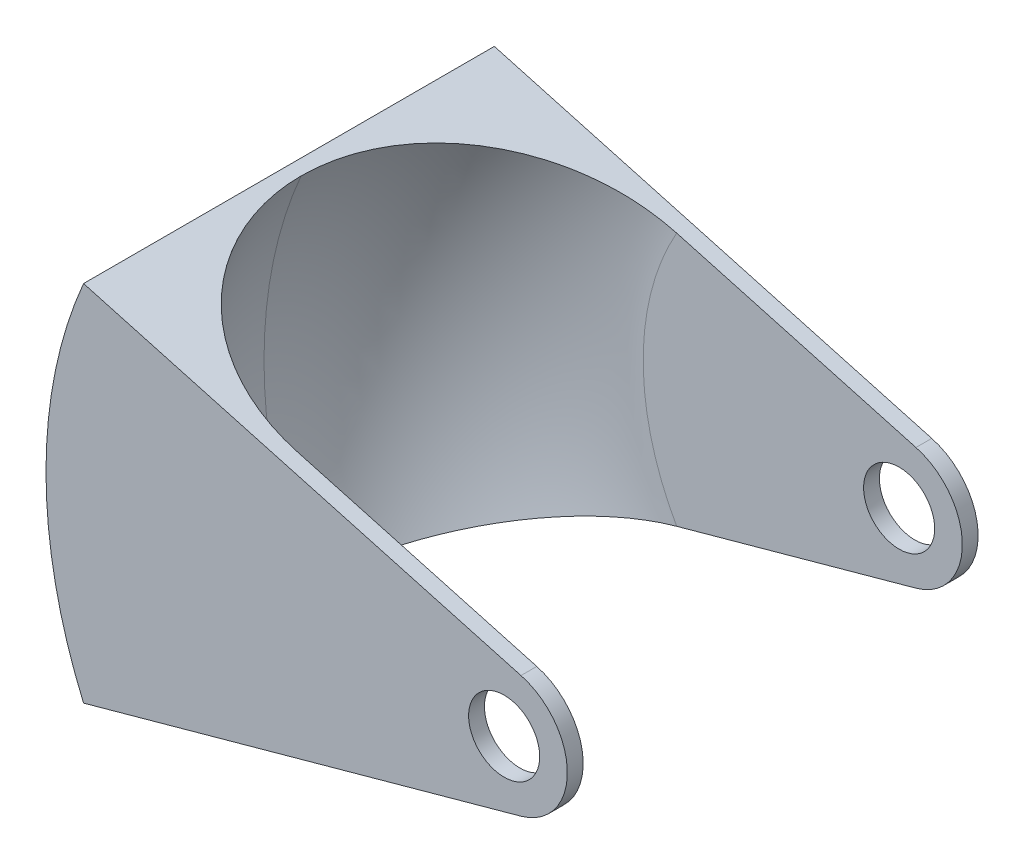
ISO-10303-21;
HEADER;
FILE_DESCRIPTION(('STEP AP214'),'2;1');
FILE_NAME('part.step','',(''),(''),'','','');
FILE_SCHEMA(('AUTOMOTIVE_DESIGN { 1 0 10303 214 1 1 1 1 }'));
ENDSEC;
DATA;
#1=APPLICATION_CONTEXT('core data for automotive mechanical design processes');
#2=APPLICATION_PROTOCOL_DEFINITION('international standard','automotive_design',2000,#1);
#3=PRODUCT_CONTEXT('',#1,'mechanical');
#4=PRODUCT('Part','Part','',(#3));
#5=PRODUCT_RELATED_PRODUCT_CATEGORY('part','',(#4));
#6=PRODUCT_DEFINITION_FORMATION('','',#4);
#7=PRODUCT_DEFINITION_CONTEXT('part definition',#1,'design');
#8=PRODUCT_DEFINITION('design','',#6,#7);
#9=PRODUCT_DEFINITION_SHAPE('','',#8);
#10=(LENGTH_UNIT() NAMED_UNIT(*) SI_UNIT(.MILLI.,.METRE.));
#11=(NAMED_UNIT(*) PLANE_ANGLE_UNIT() SI_UNIT($,.RADIAN.));
#12=(NAMED_UNIT(*) SI_UNIT($,.STERADIAN.) SOLID_ANGLE_UNIT());
#13=UNCERTAINTY_MEASURE_WITH_UNIT(LENGTH_MEASURE(1.E-05),#10,'distance_accuracy_value','');
#14=(GEOMETRIC_REPRESENTATION_CONTEXT(3) GLOBAL_UNCERTAINTY_ASSIGNED_CONTEXT((#13)) GLOBAL_UNIT_ASSIGNED_CONTEXT((#10,
#11,#12)) REPRESENTATION_CONTEXT('',''));
#15=CARTESIAN_POINT('',(0.,0.,0.));
#16=DIRECTION('',(0.,0.,1.));
#17=DIRECTION('',(1.,0.,0.));
#18=AXIS2_PLACEMENT_3D('',#15,#16,#17);
#19=CARTESIAN_POINT('',(-184.15,-73.025,-158.75));
#20=DIRECTION('',(0.,0.,-1.));
#21=DIRECTION('',(-1.,0.,0.));
#22=AXIS2_PLACEMENT_3D('',#19,#20,#21);
#23=PLANE('',#22);
#24=CARTESIAN_POINT('',(0.,0.,-158.75));
#25=DIRECTION('',(0.,0.,-1.));
#26=DIRECTION('',(-1.,0.,0.));
#27=AXIS2_PLACEMENT_3D('',#24,#25,#26);
#28=CIRCLE('',#27,14.2875);
#29=CARTESIAN_POINT('',(-14.2875,0.,-158.75));
#30=VERTEX_POINT('',#29);
#31=EDGE_CURVE('E159',#30,#30,#28,.F.);
#32=ORIENTED_EDGE('',*,*,#31,.F.);
#33=EDGE_LOOP('',(#32));
#34=FACE_BOUND('',#33,.T.);
#35=DIRECTION('',(-0.963934656431022,0.266139020309326,0.));
#36=VECTOR('',#35,1.);
#37=CARTESIAN_POINT('',(6.75993111585689,24.483940273348,-158.75));
#38=LINE('',#37,#36);
#39=CARTESIAN_POINT('',(6.75993111585689,24.483940273348,-158.75));
#40=VERTEX_POINT('',#39);
#41=CARTESIAN_POINT('',(-89.4077971932649,51.0355170081498,-158.75));
#42=VERTEX_POINT('',#41);
#43=EDGE_CURVE('E189',#40,#42,#38,.T.);
#44=ORIENTED_EDGE('',*,*,#43,.T.);
#45=CARTESIAN_POINT('',(0.599504236893755,0.,-158.75));
#46=DIRECTION('',(0.,0.,-1.));
#47=DIRECTION('',(-1.,0.,0.));
#48=AXIS2_PLACEMENT_3D('',#45,#46,#47);
#49=CIRCLE('',#48,103.469504236894);
#50=CARTESIAN_POINT('',(-89.4077971932647,-51.0355170081498,-158.75));
#51=VERTEX_POINT('',#50);
#52=EDGE_CURVE('E208',#42,#51,#49,.F.);
#53=ORIENTED_EDGE('',*,*,#52,.T.);
#54=DIRECTION('',(0.963934656431022,0.266139020309326,0.));
#55=VECTOR('',#54,1.);
#56=CARTESIAN_POINT('',(-169.051979802072,-73.025,-158.75));
#57=LINE('',#56,#55);
#58=CARTESIAN_POINT('',(6.7599311158569,-24.483940273348,-158.75));
#59=VERTEX_POINT('',#58);
#60=EDGE_CURVE('E190',#51,#59,#57,.T.);
#61=ORIENTED_EDGE('',*,*,#60,.T.);
#62=CARTESIAN_POINT('',(0.,0.,-158.75));
#63=DIRECTION('',(0.,0.,-1.));
#64=DIRECTION('',(-1.,0.,0.));
#65=AXIS2_PLACEMENT_3D('',#62,#63,#64);
#66=CIRCLE('',#65,25.4);
#67=EDGE_CURVE('E186',#59,#40,#66,.F.);
#68=ORIENTED_EDGE('',*,*,#67,.T.);
#69=EDGE_LOOP('',(#44,#53,#61,#68));
#70=FACE_BOUND('',#69,.T.);
#71=ADVANCED_FACE('F45',(#34,#70),#23,.F.);
#72=CARTESIAN_POINT('',(0.,0.,-165.1));
#73=DIRECTION('',(0.,0.,1.));
#74=DIRECTION('',(1.,0.,0.));
#75=AXIS2_PLACEMENT_3D('',#72,#73,#74);
#76=CYLINDRICAL_SURFACE('',#75,25.4);
#77=ORIENTED_EDGE('',*,*,#67,.F.);
#78=DIRECTION('',(0.,0.,1.));
#79=VECTOR('',#78,1.);
#80=CARTESIAN_POINT('',(6.75993111585689,-24.483940273348,-165.1));
#81=LINE('',#80,#79);
#82=CARTESIAN_POINT('',(6.75993111585689,-24.483940273348,-165.1));
#83=VERTEX_POINT('',#82);
#84=EDGE_CURVE('E169',#83,#59,#81,.T.);
#85=ORIENTED_EDGE('',*,*,#84,.F.);
#86=CARTESIAN_POINT('',(0.,0.,-165.1));
#87=DIRECTION('',(0.,0.,1.));
#88=DIRECTION('',(1.,0.,0.));
#89=AXIS2_PLACEMENT_3D('',#86,#87,#88);
#90=CIRCLE('',#89,25.4);
#91=CARTESIAN_POINT('',(6.75993111585689,24.483940273348,-165.1));
#92=VERTEX_POINT('',#91);
#93=EDGE_CURVE('E150',#83,#92,#90,.T.);
#94=ORIENTED_EDGE('',*,*,#93,.T.);
#95=DIRECTION('',(0.,0.,1.));
#96=VECTOR('',#95,1.);
#97=CARTESIAN_POINT('',(6.75993111585689,24.483940273348,-165.1));
#98=LINE('',#97,#96);
#99=EDGE_CURVE('E170',#92,#40,#98,.T.);
#100=ORIENTED_EDGE('',*,*,#99,.T.);
#101=EDGE_LOOP('',(#77,#85,#94,#100));
#102=FACE_BOUND('',#101,.T.);
#103=ADVANCED_FACE('F249',(#102),#76,.T.);
#104=CARTESIAN_POINT('',(-169.051979802072,-73.025,-165.1));
#105=DIRECTION('',(0.266139020309326,-0.963934656431022,0.));
#106=DIRECTION('',(0.963934656431022,0.266139020309326,0.));
#107=AXIS2_PLACEMENT_3D('',#104,#105,#106);
#108=PLANE('',#107);
#109=ORIENTED_EDGE('',*,*,#60,.F.);
#110=CARTESIAN_POINT('',(-89.4077971932648,-51.0355170081498,-158.75));
#111=CARTESIAN_POINT('',(-90.4655688461048,-51.3275640981882,-158.750016629747));
#112=CARTESIAN_POINT('',(-91.5233500341125,-51.6196138208533,-158.727706830901));
#113=CARTESIAN_POINT('',(-93.6371713132378,-52.2032325553621,-158.63829112092));
#114=CARTESIAN_POINT('',(-94.6932113693814,-52.4948015575495,-158.571184320682));
#115=CARTESIAN_POINT('',(-96.8018500538001,-53.0769893956083,-158.392022677165));
#116=CARTESIAN_POINT('',(-97.8544483393482,-53.367608136854,-158.279963487225));
#117=CARTESIAN_POINT('',(-99.9542854295265,-53.947365885225,-158.010874058202));
#118=CARTESIAN_POINT('',(-101.001524269907,-54.2365049022209,-157.853844119499));
#119=CARTESIAN_POINT('',(-103.08915190001,-54.8128916609494,-157.494821139265));
#120=CARTESIAN_POINT('',(-104.129538468974,-55.1001387895381,-157.292814194581));
#121=CARTESIAN_POINT('',(-106.201393764628,-55.6721708613484,-156.844005634722));
#122=CARTESIAN_POINT('',(-107.232861691721,-55.956955583804,-156.597200045885));
#123=CARTESIAN_POINT('',(-109.284817444043,-56.5234934606171,-156.059096000549));
#124=CARTESIAN_POINT('',(-110.305306675092,-56.8052470031168,-155.767803314986));
#125=CARTESIAN_POINT('',(-112.33370122637,-57.3652797139198,-155.141022732361));
#126=CARTESIAN_POINT('',(-113.341605347766,-57.6435585512294,-154.805530659586));
#127=CARTESIAN_POINT('',(-115.361664525464,-58.2012898942542,-154.08411660942));
#128=CARTESIAN_POINT('',(-116.373545188463,-58.4806666409286,-153.697367291957));
#129=CARTESIAN_POINT('',(-118.380425517133,-59.0347593493782,-152.879013669297));
#130=CARTESIAN_POINT('',(-119.375423519871,-59.3094748520233,-152.447404974972));
#131=CARTESIAN_POINT('',(-121.346482488791,-59.8536774071037,-151.540057956973));
#132=CARTESIAN_POINT('',(-122.322544480378,-60.1231647426497,-151.064322030948));
#133=CARTESIAN_POINT('',(-124.254000940688,-60.6564331822556,-150.069421356869));
#134=CARTESIAN_POINT('',(-125.209393395984,-60.9202137304151,-149.550252401749));
#135=CARTESIAN_POINT('',(-127.09695987615,-61.4413642985045,-148.469735493029));
#136=CARTESIAN_POINT('',(-128.029148346144,-61.6987383066832,-147.908414701177));
#137=CARTESIAN_POINT('',(-129.869212253612,-62.2067735789633,-146.744208689799));
#138=CARTESIAN_POINT('',(-130.777085257992,-62.457434171296,-146.141319332186));
#139=CARTESIAN_POINT('',(-132.566545720564,-62.9514980076918,-144.895142646856));
#140=CARTESIAN_POINT('',(-133.448136582393,-63.1949021914873,-144.251860583959));
#141=CARTESIAN_POINT('',(-135.183443246735,-63.6740143517389,-142.925970297819));
#142=CARTESIAN_POINT('',(-136.037156374538,-63.909721589717,-142.243358318362));
#143=CARTESIAN_POINT('',(-138.50855975899,-64.5920675051161,-140.176264484614));
#144=CARTESIAN_POINT('',(-140.085285119259,-65.0273959165175,-138.738476433746));
#145=CARTESIAN_POINT('',(-143.114683322661,-65.8638022689619,-135.72851605981));
#146=CARTESIAN_POINT('',(-144.567357375948,-66.2648805441242,-134.156345047984));
#147=CARTESIAN_POINT('',(-146.645029145685,-66.838518524285,-131.705917245745));
#148=CARTESIAN_POINT('',(-147.320855453424,-67.0251118273073,-130.873522727526));
#149=CARTESIAN_POINT('',(-148.637458542161,-67.3886213804028,-129.179465085388));
#150=CARTESIAN_POINT('',(-149.278238792717,-67.5655385884095,-128.317804872513));
#151=CARTESIAN_POINT('',(-150.523586137151,-67.9093746772783,-126.566687490214));
#152=CARTESIAN_POINT('',(-151.128150483768,-68.0762927996315,-125.677228219782));
#153=CARTESIAN_POINT('',(-152.299818183182,-68.3997861936804,-123.872260555779));
#154=CARTESIAN_POINT('',(-152.866925239209,-68.5563624878249,-122.956754750152));
#155=CARTESIAN_POINT('',(-153.954637580152,-68.8566760981571,-121.114859310508));
#156=CARTESIAN_POINT('',(-154.47580175669,-69.0005677223857,-120.188824799158));
#157=CARTESIAN_POINT('',(-155.479745649692,-69.2777531543508,-118.314743441774));
#158=CARTESIAN_POINT('',(-155.962529111946,-69.411047996287,-117.366698755535));
#159=CARTESIAN_POINT('',(-156.888939079825,-69.666826580044,-115.450054498626));
#160=CARTESIAN_POINT('',(-157.332559518801,-69.7893086468838,-114.481451772086));
#161=CARTESIAN_POINT('',(-158.179691792866,-70.0231989339358,-112.52565997174));
#162=CARTESIAN_POINT('',(-158.583207414851,-70.1346081996969,-111.538472663274));
#163=CARTESIAN_POINT('',(-159.349208750081,-70.346098515512,-109.547753402922));
#164=CARTESIAN_POINT('',(-159.711717340257,-70.4461858818077,-108.544230925113));
#165=CARTESIAN_POINT('',(-160.395255296282,-70.6349083442141,-106.522203420425));
#166=CARTESIAN_POINT('',(-160.716288578364,-70.7235445215837,-105.503699818244));
#167=CARTESIAN_POINT('',(-161.316260065834,-70.8891945714325,-103.453639131762));
#168=CARTESIAN_POINT('',(-161.595206165373,-70.9662106234594,-102.422084534832));
#169=CARTESIAN_POINT('',(-162.110531648899,-71.1084902047684,-100.347693290117));
#170=CARTESIAN_POINT('',(-162.346914144909,-71.1737545932688,-99.3048574730676));
#171=CARTESIAN_POINT('',(-162.826566437967,-71.306184930234,-96.9665643862472));
#172=CARTESIAN_POINT('',(-163.058708902292,-71.3702786606703,-95.6686333379788));
#173=CARTESIAN_POINT('',(-163.457061348196,-71.4802623913968,-93.0620647227455));
#174=CARTESIAN_POINT('',(-163.623276855148,-71.5261539172231,-91.7534280624099));
#175=CARTESIAN_POINT('',(-163.889121423905,-71.5995526819749,-89.1309417310484));
#176=CARTESIAN_POINT('',(-163.988853330833,-71.6270883160829,-87.817103289165));
#177=CARTESIAN_POINT('',(-164.121913297815,-71.6638257121488,-85.1855107122061));
#178=CARTESIAN_POINT('',(-164.155226116732,-71.6730232660816,-83.8677557478686));
#179=CARTESIAN_POINT('',(-164.155191747402,-71.6730137768286,-82.55));
#180=B_SPLINE_CURVE_WITH_KNOTS('',3,(#110,#111,#112,#113,#114,#115,#116,#117,#118,#119,#120,
#121,#122,#123,#124,#125,#126,#127,#128,#129,#130,#131,#132,#133,#134,#135,#136,#137,#138,#139,
#140,#141,#142,#143,#144,#145,#146,#147,#148,#149,#150,#151,#152,#153,#154,#155,#156,#157,#158,
#159,#160,#161,#162,#163,#164,#165,#166,#167,#168,#169,#170,#171,#172,#173,#174,#175,#176,#177,
#178,#179),.UNSPECIFIED.,.F.,.F.,(4,2,2,2,2,2,2,2,2,2,2,2,2,2,2,2,2,2,2,2,2,2,2,2,2,2,2,2,2,2,2,
2,2,2,4),(0.,3.29183134832938,6.58372803268538,9.87594310295202,13.1681361836255,
16.4613483532606,19.7548527753159,23.0479303212036,26.3413192022151,29.6964352664882,
33.051879911498,36.4071423455243,39.7627301585446,43.1161739562496,46.4699520674164,
49.8232939480533,53.1769566230482,59.7019455716888,66.2268708600167,69.4909937669997,
72.7547929386316,76.0188393822392,79.2825626400961,82.4985428049804,85.7142087179249,
88.9303718910444,92.1462310889784,95.3602872877417,98.5740397826414,101.787188733445,
105.0001026606,108.958479349889,112.916524215479,116.868431986894,120.821246495239),.UNSPECIFIED.);
#181=CARTESIAN_POINT('',(-164.155191747402,-71.6730137768286,-82.55));
#182=VERTEX_POINT('',#181);
#183=EDGE_CURVE('E11',#51,#182,#180,.T.);
#184=ORIENTED_EDGE('',*,*,#183,.T.);
#185=CARTESIAN_POINT('',(-164.155191747402,-71.6730137768286,-82.55));
#186=CARTESIAN_POINT('',(-164.15520609273,-71.6730177375241,-81.4871863440123));
#187=CARTESIAN_POINT('',(-164.133543852967,-71.6670368681469,-80.4243738699779));
#188=CARTESIAN_POINT('',(-164.046969342689,-71.643133945687,-78.3006498670434));
#189=CARTESIAN_POINT('',(-163.982057219621,-71.6252119333138,-77.239738331675));
#190=CARTESIAN_POINT('',(-163.809091089027,-71.577456583679,-75.1217688398414));
#191=CARTESIAN_POINT('',(-163.70103957996,-71.5476239362332,-74.0647106637824));
#192=CARTESIAN_POINT('',(-163.441998729391,-71.47610365451,-71.9562727887514));
#193=CARTESIAN_POINT('',(-163.291009425333,-71.4344160305709,-70.9048930848283));
#194=CARTESIAN_POINT('',(-162.946544481479,-71.3393104525357,-68.8107443833674));
#195=CARTESIAN_POINT('',(-162.753111911701,-71.2859043899222,-67.7679677608018));
#196=CARTESIAN_POINT('',(-162.324008748865,-71.1674304927479,-65.6917078276618));
#197=CARTESIAN_POINT('',(-162.088334204963,-71.1023615673726,-64.6582253958658));
#198=CARTESIAN_POINT('',(-161.575219518481,-70.9606923794712,-62.6025949565669));
#199=CARTESIAN_POINT('',(-161.297783724331,-70.8840933175315,-61.5804457808614));
#200=CARTESIAN_POINT('',(-160.701610604333,-70.719491983787,-59.5490891335786));
#201=CARTESIAN_POINT('',(-160.382869411902,-70.6314886444321,-58.5398828833157));
#202=CARTESIAN_POINT('',(-159.704581369724,-70.444215665057,-56.535971127331));
#203=CARTESIAN_POINT('',(-159.345021340767,-70.3449423863024,-55.5412704226716));
#204=CARTESIAN_POINT('',(-158.585803851875,-70.135325066967,-53.5683690474537));
#205=CARTESIAN_POINT('',(-158.186142642612,-70.02497999121,-52.590169929745));
#206=CARTESIAN_POINT('',(-157.347519505154,-69.793439047306,-50.6521735659549));
#207=CARTESIAN_POINT('',(-156.908560908634,-69.672244099023,-49.6923747682352));
#208=CARTESIAN_POINT('',(-155.992075805071,-69.4192057359317,-47.7926922425459));
#209=CARTESIAN_POINT('',(-155.514545700379,-69.2873613278247,-46.852810382618));
#210=CARTESIAN_POINT('',(-154.521930958667,-69.0133038352951,-44.9948965534347));
#211=CARTESIAN_POINT('',(-154.006854299788,-68.8710929536098,-44.0768599970179));
#212=CARTESIAN_POINT('',(-152.939952587185,-68.5765250856902,-42.2639528746993));
#213=CARTESIAN_POINT('',(-152.388124121719,-68.4241671574862,-41.3690844702801));
#214=CARTESIAN_POINT('',(-151.248806178812,-68.1096054191742,-39.6042250785748));
#215=CARTESIAN_POINT('',(-150.661320152312,-67.9474025618592,-38.7342316958325));
#216=CARTESIAN_POINT('',(-149.451713032923,-67.6134342253483,-37.0205221952245));
#217=CARTESIAN_POINT('',(-148.829588712029,-67.4416678549118,-36.1768085378763));
#218=CARTESIAN_POINT('',(-146.909209767367,-66.9114578790121,-33.6825045943551));
#219=CARTESIAN_POINT('',(-145.560058960411,-66.5389620136366,-32.0735677764436));
#220=CARTESIAN_POINT('',(-142.736867941031,-65.7594887505568,-28.9787093519041));
#221=CARTESIAN_POINT('',(-141.262827087565,-65.3525111758633,-27.4927883767741));
#222=CARTESIAN_POINT('',(-138.200152099956,-64.5069172185447,-24.6535396602136));
#223=CARTESIAN_POINT('',(-136.611505565877,-64.06829741234,-23.300226303936));
#224=CARTESIAN_POINT('',(-133.331252244519,-63.162630830598,-20.7354118386252));
#225=CARTESIAN_POINT('',(-131.639646126216,-62.6955842397625,-19.5239098083279));
#226=CARTESIAN_POINT('',(-128.149561382599,-61.7319839290299,-17.240038692237));
#227=CARTESIAN_POINT('',(-126.350244788385,-61.2351988488217,-16.1690477406709));
#228=CARTESIAN_POINT('',(-122.671848713064,-60.2196064315721,-14.1860961573351));
#229=CARTESIAN_POINT('',(-120.792764884614,-59.700797894244,-13.2741442071223));
#230=CARTESIAN_POINT('',(-116.968562444279,-58.6449488445755,-11.6148794966609));
#231=CARTESIAN_POINT('',(-115.023451810014,-58.1079105348283,-10.8675469275875));
#232=CARTESIAN_POINT('',(-111.08080977253,-57.0193607225708,-9.54155347463767));
#233=CARTESIAN_POINT('',(-109.083288279991,-56.4678519563651,-8.96286094862865));
#234=CARTESIAN_POINT('',(-105.620047713986,-55.5116632301036,-8.11615125218891));
#235=CARTESIAN_POINT('',(-104.163628740871,-55.1095509955464,-7.80655485854486));
#236=CARTESIAN_POINT('',(-101.236073499125,-54.3012631321092,-7.27596346605321));
#237=CARTESIAN_POINT('',(-99.7649397048523,-53.895088186391,-7.05495381940737));
#238=CARTESIAN_POINT('',(-96.8152542087748,-53.0806902363751,-6.70197649540314));
#239=CARTESIAN_POINT('',(-95.3367193345219,-52.6724718781061,-6.56985833052524));
#240=CARTESIAN_POINT('',(-93.1153444292531,-52.0591579599025,-6.4378641261461));
#241=CARTESIAN_POINT('',(-92.3742045680975,-51.8545318109782,-6.40489658132852));
#242=CARTESIAN_POINT('',(-90.8913218729215,-51.4451130344099,-6.36096431503527));
#243=CARTESIAN_POINT('',(-90.1495790414491,-51.2403204074694,-6.34999950106202));
#244=CARTESIAN_POINT('',(-89.4077971932647,-51.0355170081498,-6.34999999999999));
#245=B_SPLINE_CURVE_WITH_KNOTS('',3,(#185,#186,#187,#188,#189,#190,#191,#192,#193,#194,#195,
#196,#197,#198,#199,#200,#201,#202,#203,#204,#205,#206,#207,#208,#209,#210,#211,#212,#213,#214,
#215,#216,#217,#218,#219,#220,#221,#222,#223,#224,#225,#226,#227,#228,#229,#230,#231,#232,#233,
#234,#235,#236,#237,#238,#239,#240,#241,#242,#243,#244),.UNSPECIFIED.,.F.,.F.,(4,2,2,2,2,2,2,2,
2,2,2,2,2,2,2,2,2,2,2,2,2,2,2,2,2,2,2,2,2,4),(0.,3.18820170907249,6.37639254903345,
9.56439876863611,12.7524022081165,15.9371854069399,19.122266630546,22.3070164336525,
25.4920645756616,28.6781440172765,31.8645216247958,35.0506293431039,38.2370345806729,
41.4227647122716,44.6087909946407,47.7945094232769,50.980525233128,57.3698933461778,
63.7592942568188,70.1493875182574,76.5394392647429,82.9881040723787,89.4371207870172,
95.885361060198,102.332390662208,106.956843433806,111.580531237454,116.196371607935,
118.504827091008,120.813272869513),.UNSPECIFIED.);
#246=CARTESIAN_POINT('',(-89.4077971932647,-51.0355170081498,-6.35));
#247=VERTEX_POINT('',#246);
#248=EDGE_CURVE('E218',#182,#247,#245,.T.);
#249=ORIENTED_EDGE('',*,*,#248,.T.);
#250=DIRECTION('',(-0.963934656431022,-0.266139020309326,0.));
#251=VECTOR('',#250,1.);
#252=CARTESIAN_POINT('',(-169.051979802072,-73.025,-6.34999999999999));
#253=LINE('',#252,#251);
#254=CARTESIAN_POINT('',(6.7599311158569,-24.483940273348,-6.35));
#255=VERTEX_POINT('',#254);
#256=EDGE_CURVE('E127',#255,#247,#253,.T.);
#257=ORIENTED_EDGE('',*,*,#256,.F.);
#258=DIRECTION('',(0.,0.,1.));
#259=VECTOR('',#258,1.);
#260=CARTESIAN_POINT('',(6.75993111585689,-24.483940273348,-165.1));
#261=LINE('',#260,#259);
#262=CARTESIAN_POINT('',(6.75993111585689,-24.483940273348,0.));
#263=VERTEX_POINT('',#262);
#264=EDGE_CURVE('E136',#255,#263,#261,.T.);
#265=ORIENTED_EDGE('',*,*,#264,.T.);
#266=DIRECTION('',(0.963934656431022,0.266139020309326,0.));
#267=VECTOR('',#266,1.);
#268=CARTESIAN_POINT('',(-169.051979802072,-73.025,0.));
#269=LINE('',#268,#267);
#270=CARTESIAN_POINT('',(-169.051979802072,-73.025,0.));
#271=VERTEX_POINT('',#270);
#272=EDGE_CURVE('E146',#271,#263,#269,.T.);
#273=ORIENTED_EDGE('',*,*,#272,.F.);
#274=DIRECTION('',(0.,0.,1.));
#275=VECTOR('',#274,1.);
#276=CARTESIAN_POINT('',(-169.051979802072,-73.025,-165.1));
#277=LINE('',#276,#275);
#278=CARTESIAN_POINT('',(-169.051979802072,-73.025,-165.1));
#279=VERTEX_POINT('',#278);
#280=EDGE_CURVE('E175',#279,#271,#277,.T.);
#281=ORIENTED_EDGE('',*,*,#280,.F.);
#282=DIRECTION('',(0.963934656431022,0.266139020309326,0.));
#283=VECTOR('',#282,1.);
#284=CARTESIAN_POINT('',(-169.051979802072,-73.025,-165.1));
#285=LINE('',#284,#283);
#286=EDGE_CURVE('E165',#279,#83,#285,.T.);
#287=ORIENTED_EDGE('',*,*,#286,.T.);
#288=ORIENTED_EDGE('',*,*,#84,.T.);
#289=EDGE_LOOP('',(#109,#184,#249,#257,#265,#273,#281,#287,#288));
#290=FACE_BOUND('',#289,.T.);
#291=ADVANCED_FACE('F245',(#290),#108,.T.);
#292=CARTESIAN_POINT('',(0.,0.,-165.1));
#293=DIRECTION('',(0.,0.,1.));
#294=DIRECTION('',(1.,0.,0.));
#295=AXIS2_PLACEMENT_3D('',#292,#293,#294);
#296=CYLINDRICAL_SURFACE('',#295,184.15);
#297=ORIENTED_EDGE('',*,*,#280,.T.);
#298=CARTESIAN_POINT('',(0.,0.,0.));
#299=DIRECTION('',(0.,0.,1.));
#300=DIRECTION('',(1.,0.,0.));
#301=AXIS2_PLACEMENT_3D('',#298,#299,#300);
#302=CIRCLE('',#301,184.15);
#303=CARTESIAN_POINT('',(-169.051979802072,73.025,0.));
#304=VERTEX_POINT('',#303);
#305=EDGE_CURVE('E153',#304,#271,#302,.T.);
#306=ORIENTED_EDGE('',*,*,#305,.F.);
#307=DIRECTION('',(0.,0.,1.));
#308=VECTOR('',#307,1.);
#309=CARTESIAN_POINT('',(-169.051979802072,73.025,-165.1));
#310=LINE('',#309,#308);
#311=CARTESIAN_POINT('',(-169.051979802072,73.025,-165.1));
#312=VERTEX_POINT('',#311);
#313=EDGE_CURVE('E164',#312,#304,#310,.T.);
#314=ORIENTED_EDGE('',*,*,#313,.F.);
#315=CARTESIAN_POINT('',(0.,0.,-165.1));
#316=DIRECTION('',(0.,0.,1.));
#317=DIRECTION('',(1.,0.,0.));
#318=AXIS2_PLACEMENT_3D('',#315,#316,#317);
#319=CIRCLE('',#318,184.15);
#320=EDGE_CURVE('E171',#312,#279,#319,.T.);
#321=ORIENTED_EDGE('',*,*,#320,.T.);
#322=EDGE_LOOP('',(#297,#306,#314,#321));
#323=FACE_BOUND('',#322,.T.);
#324=ADVANCED_FACE('F233',(#323),#296,.T.);
#325=CARTESIAN_POINT('',(6.75993111585689,24.483940273348,-165.1));
#326=DIRECTION('',(0.266139020309326,0.963934656431022,0.));
#327=DIRECTION('',(-0.963934656431022,0.266139020309326,0.));
#328=AXIS2_PLACEMENT_3D('',#325,#326,#327);
#329=PLANE('',#328);
#330=ORIENTED_EDGE('',*,*,#43,.F.);
#331=ORIENTED_EDGE('',*,*,#99,.F.);
#332=DIRECTION('',(-0.963934656431022,0.266139020309326,0.));
#333=VECTOR('',#332,1.);
#334=CARTESIAN_POINT('',(6.75993111585689,24.483940273348,-165.1));
#335=LINE('',#334,#333);
#336=EDGE_CURVE('E176',#92,#312,#335,.T.);
#337=ORIENTED_EDGE('',*,*,#336,.T.);
#338=ORIENTED_EDGE('',*,*,#313,.T.);
#339=DIRECTION('',(-0.963934656431022,0.266139020309326,0.));
#340=VECTOR('',#339,1.);
#341=CARTESIAN_POINT('',(6.75993111585689,24.483940273348,0.));
#342=LINE('',#341,#340);
#343=CARTESIAN_POINT('',(6.75993111585689,24.483940273348,0.));
#344=VERTEX_POINT('',#343);
#345=EDGE_CURVE('E143',#344,#304,#342,.T.);
#346=ORIENTED_EDGE('',*,*,#345,.F.);
#347=DIRECTION('',(0.,0.,1.));
#348=VECTOR('',#347,1.);
#349=CARTESIAN_POINT('',(6.75993111585689,24.483940273348,-165.1));
#350=LINE('',#349,#348);
#351=CARTESIAN_POINT('',(6.75993111585689,24.483940273348,-6.34999999999999));
#352=VERTEX_POINT('',#351);
#353=EDGE_CURVE('E134',#352,#344,#350,.T.);
#354=ORIENTED_EDGE('',*,*,#353,.F.);
#355=DIRECTION('',(0.963934656431022,-0.266139020309326,0.));
#356=VECTOR('',#355,1.);
#357=CARTESIAN_POINT('',(6.7599311158569,24.483940273348,-6.34999999999999));
#358=LINE('',#357,#356);
#359=CARTESIAN_POINT('',(-89.4077971932649,51.0355170081498,-6.34999999999999));
#360=VERTEX_POINT('',#359);
#361=EDGE_CURVE('E117',#360,#352,#358,.T.);
#362=ORIENTED_EDGE('',*,*,#361,.F.);
#363=CARTESIAN_POINT('',(-89.4077971932648,51.0355170081498,-6.35));
#364=CARTESIAN_POINT('',(-90.4655688461048,51.3275640981882,-6.34998337025323));
#365=CARTESIAN_POINT('',(-91.5233500341126,51.6196138208533,-6.37229316909881));
#366=CARTESIAN_POINT('',(-93.6371713132378,52.2032325553621,-6.4617088790804));
#367=CARTESIAN_POINT('',(-94.6932113693815,52.4948015575495,-6.52881567931757));
#368=CARTESIAN_POINT('',(-96.8018500538001,53.0769893956083,-6.70797732283453));
#369=CARTESIAN_POINT('',(-97.8544483393482,53.367608136854,-6.82003651277478));
#370=CARTESIAN_POINT('',(-99.9542854295265,53.947365885225,-7.08912594179762));
#371=CARTESIAN_POINT('',(-101.001524269907,54.2365049022209,-7.24615588050143));
#372=CARTESIAN_POINT('',(-103.089151900011,54.8128916609495,-7.60517886073545));
#373=CARTESIAN_POINT('',(-104.129538468974,55.1001387895381,-7.80718580541916));
#374=CARTESIAN_POINT('',(-106.201393764628,55.6721708613484,-8.25599436527813));
#375=CARTESIAN_POINT('',(-107.232861691721,55.956955583804,-8.50279995411527));
#376=CARTESIAN_POINT('',(-109.284817444043,56.5234934606172,-9.04090399945071));
#377=CARTESIAN_POINT('',(-110.305306675092,56.8052470031168,-9.33219668501395));
#378=CARTESIAN_POINT('',(-112.33370122637,57.3652797139198,-9.95897726763909));
#379=CARTESIAN_POINT('',(-113.341605347766,57.6435585512294,-10.2944693404143));
#380=CARTESIAN_POINT('',(-115.361664525464,58.2012898942542,-11.0158833905797));
#381=CARTESIAN_POINT('',(-116.373545188463,58.4806666409286,-11.4026327080434));
#382=CARTESIAN_POINT('',(-118.380425517133,59.0347593493782,-12.2209863307029));
#383=CARTESIAN_POINT('',(-119.375423519871,59.3094748520233,-12.6525950250284));
#384=CARTESIAN_POINT('',(-121.346482488791,59.8536774071037,-13.5599420430268));
#385=CARTESIAN_POINT('',(-122.322544480378,60.1231647426498,-14.0356779690521));
#386=CARTESIAN_POINT('',(-124.254000940688,60.6564331822556,-15.0305786431307));
#387=CARTESIAN_POINT('',(-125.209393395984,60.9202137304151,-15.5497475982513));
#388=CARTESIAN_POINT('',(-127.09695987615,61.4413642985046,-16.6302645069706));
#389=CARTESIAN_POINT('',(-128.029148346144,61.6987383066833,-17.1915852988227));
#390=CARTESIAN_POINT('',(-129.869212253612,62.2067735789633,-18.3557913102014));
#391=CARTESIAN_POINT('',(-130.777085257993,62.457434171296,-18.9586806678141));
#392=CARTESIAN_POINT('',(-132.566545720564,62.9514980076918,-20.2048573531436));
#393=CARTESIAN_POINT('',(-133.448136582393,63.1949021914873,-20.8481394160409));
#394=CARTESIAN_POINT('',(-135.183443246735,63.674014351739,-22.1740297021813));
#395=CARTESIAN_POINT('',(-136.037156374538,63.909721589717,-22.8566416816383));
#396=CARTESIAN_POINT('',(-138.50855975899,64.5920675051161,-24.9237355153856));
#397=CARTESIAN_POINT('',(-140.085285119259,65.0273959165175,-26.3615235662539));
#398=CARTESIAN_POINT('',(-143.114683322661,65.8638022689619,-29.3714839401898));
#399=CARTESIAN_POINT('',(-144.567357375948,66.2648805441242,-30.9436549520156));
#400=CARTESIAN_POINT('',(-146.645029145685,66.838518524285,-33.3940827542546));
#401=CARTESIAN_POINT('',(-147.320855453424,67.0251118273073,-34.2264772724735));
#402=CARTESIAN_POINT('',(-148.637458542161,67.3886213804028,-35.9205349146123));
#403=CARTESIAN_POINT('',(-149.278238792717,67.5655385884096,-36.7821951274869));
#404=CARTESIAN_POINT('',(-150.523586137151,67.9093746772784,-38.533312509786));
#405=CARTESIAN_POINT('',(-151.128150483768,68.0762927996315,-39.4227717802178));
#406=CARTESIAN_POINT('',(-152.299818183182,68.3997861936804,-41.2277394442208));
#407=CARTESIAN_POINT('',(-152.866925239209,68.5563624878249,-42.1432452498484));
#408=CARTESIAN_POINT('',(-153.954637580153,68.8566760981571,-43.9851406894921));
#409=CARTESIAN_POINT('',(-154.47580175669,69.0005677223857,-44.9111752008424));
#410=CARTESIAN_POINT('',(-155.479745649692,69.2777531543508,-46.7852565582258));
#411=CARTESIAN_POINT('',(-155.962529111946,69.411047996287,-47.7333012444648));
#412=CARTESIAN_POINT('',(-156.888939079825,69.666826580044,-49.6499455013738));
#413=CARTESIAN_POINT('',(-157.332559518801,69.7893086468838,-50.6185482279144));
#414=CARTESIAN_POINT('',(-158.179691792866,70.0231989339359,-52.5743400282599));
#415=CARTESIAN_POINT('',(-158.583207414851,70.1346081996969,-53.5615273367262));
#416=CARTESIAN_POINT('',(-159.349208750081,70.346098515512,-55.5522465970776));
#417=CARTESIAN_POINT('',(-159.711717340257,70.4461858818077,-56.555769074887));
#418=CARTESIAN_POINT('',(-160.395255296282,70.6349083442142,-58.5777965795748));
#419=CARTESIAN_POINT('',(-160.716288578364,70.7235445215837,-59.596300181756));
#420=CARTESIAN_POINT('',(-161.316260065834,70.8891945714325,-61.646360868238));
#421=CARTESIAN_POINT('',(-161.595206165373,70.9662106234594,-62.6779154651675));
#422=CARTESIAN_POINT('',(-162.110531648899,71.1084902047684,-64.7523067098832));
#423=CARTESIAN_POINT('',(-162.346914144909,71.1737545932688,-65.7951425269324));
#424=CARTESIAN_POINT('',(-162.826566437967,71.306184930234,-68.1334356137528));
#425=CARTESIAN_POINT('',(-163.058708902292,71.3702786606703,-69.4313666620212));
#426=CARTESIAN_POINT('',(-163.457061348196,71.4802623913969,-72.0379352772545));
#427=CARTESIAN_POINT('',(-163.623276855148,71.5261539172231,-73.3465719375901));
#428=CARTESIAN_POINT('',(-163.889121423905,71.5995526819749,-75.9690582689516));
#429=CARTESIAN_POINT('',(-163.988853330834,71.6270883160829,-77.282896710835));
#430=CARTESIAN_POINT('',(-164.121913297816,71.6638257121488,-79.9144892877939));
#431=CARTESIAN_POINT('',(-164.155226116732,71.6730232660816,-81.2322442521314));
#432=CARTESIAN_POINT('',(-164.155191747402,71.6730137768286,-82.55));
#433=B_SPLINE_CURVE_WITH_KNOTS('',3,(#363,#364,#365,#366,#367,#368,#369,#370,#371,#372,#373,
#374,#375,#376,#377,#378,#379,#380,#381,#382,#383,#384,#385,#386,#387,#388,#389,#390,#391,#392,
#393,#394,#395,#396,#397,#398,#399,#400,#401,#402,#403,#404,#405,#406,#407,#408,#409,#410,#411,
#412,#413,#414,#415,#416,#417,#418,#419,#420,#421,#422,#423,#424,#425,#426,#427,#428,#429,#430,
#431,#432),.UNSPECIFIED.,.F.,.F.,(4,2,2,2,2,2,2,2,2,2,2,2,2,2,2,2,2,2,2,2,2,2,2,2,2,2,2,2,2,2,2,
2,2,2,4),(0.,3.29183134832936,6.58372803268535,9.875943102952,13.1681361836255,16.4613483532606,
19.7548527753159,23.0479303212036,26.3413192022151,29.6964352664881,33.051879911498,
36.4071423455243,39.7627301585445,43.1161739562495,46.4699520674164,49.8232939480533,
53.1769566230482,59.7019455716888,66.2268708600167,69.4909937669997,72.7547929386316,
76.0188393822391,79.2825626400961,82.4985428049804,85.7142087179249,88.9303718910444,
92.1462310889784,95.3602872877417,98.5740397826414,101.787188733445,105.0001026606,
108.958479349889,112.916524215479,116.868431986894,120.821246495239),.UNSPECIFIED.);
#434=CARTESIAN_POINT('',(-164.155191747402,71.6730137768286,-82.55));
#435=VERTEX_POINT('',#434);
#436=EDGE_CURVE('E69',#360,#435,#433,.T.);
#437=ORIENTED_EDGE('',*,*,#436,.T.);
#438=CARTESIAN_POINT('',(-164.155191747402,71.6730137768286,-82.55));
#439=CARTESIAN_POINT('',(-164.155206092731,71.6730177375242,-83.6128136559878));
#440=CARTESIAN_POINT('',(-164.133543852967,71.667036868147,-84.6756261300221));
#441=CARTESIAN_POINT('',(-164.046969342689,71.643133945687,-86.7993501329566));
#442=CARTESIAN_POINT('',(-163.982057219622,71.6252119333138,-87.860261668325));
#443=CARTESIAN_POINT('',(-163.809091089027,71.577456583679,-89.9782311601586));
#444=CARTESIAN_POINT('',(-163.70103957996,71.5476239362332,-91.0352893362177));
#445=CARTESIAN_POINT('',(-163.441998729391,71.47610365451,-93.1437272112486));
#446=CARTESIAN_POINT('',(-163.291009425333,71.434416030571,-94.1951069151717));
#447=CARTESIAN_POINT('',(-162.946544481479,71.3393104525357,-96.2892556166326));
#448=CARTESIAN_POINT('',(-162.753111911701,71.2859043899222,-97.3320322391982));
#449=CARTESIAN_POINT('',(-162.324008748865,71.1674304927479,-99.4082921723382));
#450=CARTESIAN_POINT('',(-162.088334204963,71.1023615673726,-100.441774604134));
#451=CARTESIAN_POINT('',(-161.575219518481,70.9606923794712,-102.497405043433));
#452=CARTESIAN_POINT('',(-161.297783724331,70.8840933175315,-103.519554219139));
#453=CARTESIAN_POINT('',(-160.701610604333,70.7194919837871,-105.550910866421));
#454=CARTESIAN_POINT('',(-160.382869411902,70.6314886444321,-106.560117116684));
#455=CARTESIAN_POINT('',(-159.704581369724,70.444215665057,-108.564028872669));
#456=CARTESIAN_POINT('',(-159.345021340767,70.3449423863024,-109.558729577328));
#457=CARTESIAN_POINT('',(-158.585803851875,70.1353250669671,-111.531630952546));
#458=CARTESIAN_POINT('',(-158.186142642612,70.0249799912101,-112.509830070255));
#459=CARTESIAN_POINT('',(-157.347519505154,69.793439047306,-114.447826434045));
#460=CARTESIAN_POINT('',(-156.908560908634,69.672244099023,-115.407625231765));
#461=CARTESIAN_POINT('',(-155.992075805071,69.4192057359317,-117.307307757454));
#462=CARTESIAN_POINT('',(-155.514545700379,69.2873613278247,-118.247189617382));
#463=CARTESIAN_POINT('',(-154.521930958667,69.0133038352951,-120.105103446565));
#464=CARTESIAN_POINT('',(-154.006854299788,68.8710929536098,-121.023140002982));
#465=CARTESIAN_POINT('',(-152.939952587185,68.5765250856903,-122.836047125301));
#466=CARTESIAN_POINT('',(-152.388124121719,68.4241671574862,-123.73091552972));
#467=CARTESIAN_POINT('',(-151.248806178812,68.1096054191742,-125.495774921425));
#468=CARTESIAN_POINT('',(-150.661320152312,67.9474025618592,-126.365768304168));
#469=CARTESIAN_POINT('',(-149.451713032923,67.6134342253483,-128.079477804776));
#470=CARTESIAN_POINT('',(-148.82958871203,67.4416678549118,-128.923191462124));
#471=CARTESIAN_POINT('',(-146.909209767367,66.9114578790121,-131.417495405645));
#472=CARTESIAN_POINT('',(-145.560058960411,66.5389620136366,-133.026432223556));
#473=CARTESIAN_POINT('',(-142.736867941031,65.7594887505568,-136.121290648096));
#474=CARTESIAN_POINT('',(-141.262827087565,65.3525111758634,-137.607211623226));
#475=CARTESIAN_POINT('',(-138.200152099956,64.5069172185447,-140.446460339786));
#476=CARTESIAN_POINT('',(-136.611505565877,64.0682974123401,-141.799773696064));
#477=CARTESIAN_POINT('',(-133.331252244519,63.162630830598,-144.364588161375));
#478=CARTESIAN_POINT('',(-131.639646126217,62.6955842397625,-145.576090191672));
#479=CARTESIAN_POINT('',(-128.149561382599,61.7319839290299,-147.859961307763));
#480=CARTESIAN_POINT('',(-126.350244788385,61.2351988488217,-148.930952259329));
#481=CARTESIAN_POINT('',(-122.671848713064,60.2196064315721,-150.913903842665));
#482=CARTESIAN_POINT('',(-120.792764884614,59.700797894244,-151.825855792878));
#483=CARTESIAN_POINT('',(-116.968562444279,58.6449488445756,-153.485120503339));
#484=CARTESIAN_POINT('',(-115.023451810015,58.1079105348283,-154.232453072413));
#485=CARTESIAN_POINT('',(-111.08080977253,57.0193607225708,-155.558446525362));
#486=CARTESIAN_POINT('',(-109.083288279991,56.4678519563651,-156.137139051371));
#487=CARTESIAN_POINT('',(-105.620047713986,55.5116632301036,-156.983848747811));
#488=CARTESIAN_POINT('',(-104.163628740871,55.1095509955464,-157.293445141455));
#489=CARTESIAN_POINT('',(-101.236073499125,54.3012631321092,-157.824036533947));
#490=CARTESIAN_POINT('',(-99.7649397048524,53.895088186391,-158.045046180593));
#491=CARTESIAN_POINT('',(-96.8152542087749,53.0806902363751,-158.398023504597));
#492=CARTESIAN_POINT('',(-95.336719334522,52.6724718781062,-158.530141669475));
#493=CARTESIAN_POINT('',(-93.1153444292532,52.0591579599025,-158.662135873854));
#494=CARTESIAN_POINT('',(-92.3742045680976,51.8545318109783,-158.695103418671));
#495=CARTESIAN_POINT('',(-90.8913218729216,51.4451130344099,-158.739035684965));
#496=CARTESIAN_POINT('',(-90.1495790414492,51.2403204074694,-158.750000498938));
#497=CARTESIAN_POINT('',(-89.4077971932648,51.0355170081498,-158.75));
#498=B_SPLINE_CURVE_WITH_KNOTS('',3,(#438,#439,#440,#441,#442,#443,#444,#445,#446,#447,#448,
#449,#450,#451,#452,#453,#454,#455,#456,#457,#458,#459,#460,#461,#462,#463,#464,#465,#466,#467,
#468,#469,#470,#471,#472,#473,#474,#475,#476,#477,#478,#479,#480,#481,#482,#483,#484,#485,#486,
#487,#488,#489,#490,#491,#492,#493,#494,#495,#496,#497),.UNSPECIFIED.,.F.,.F.,(4,2,2,2,2,2,2,2,
2,2,2,2,2,2,2,2,2,2,2,2,2,2,2,2,2,2,2,2,2,4),(0.,3.18820170907249,6.37639254903346,
9.56439876863611,12.7524022081165,15.9371854069399,19.122266630546,22.3070164336524,
25.4920645756616,28.6781440172765,31.8645216247958,35.0506293431039,38.2370345806729,
41.4227647122716,44.6087909946407,47.7945094232769,50.980525233128,57.3698933461778,
63.7592942568187,70.1493875182573,76.5394392647428,82.9881040723787,89.4371207870172,
95.885361060198,102.332390662208,106.956843433806,111.580531237454,116.196371607935,
118.504827091008,120.813272869513),.UNSPECIFIED.);
#499=EDGE_CURVE('E56',#435,#42,#498,.T.);
#500=ORIENTED_EDGE('',*,*,#499,.T.);
#501=EDGE_LOOP('',(#330,#331,#337,#338,#346,#354,#362,#437,#500));
#502=FACE_BOUND('',#501,.T.);
#503=ADVANCED_FACE('F141',(#502),#329,.T.);
#504=CARTESIAN_POINT('',(0.,0.,-165.1));
#505=DIRECTION('',(0.,0.,1.));
#506=DIRECTION('',(1.,0.,0.));
#507=AXIS2_PLACEMENT_3D('',#504,#505,#506);
#508=CYLINDRICAL_SURFACE('',#507,14.2875);
#509=ORIENTED_EDGE('',*,*,#31,.T.);
#510=EDGE_LOOP('',(#509));
#511=FACE_BOUND('',#510,.T.);
#512=CARTESIAN_POINT('',(0.,0.,-165.1));
#513=DIRECTION('',(0.,0.,1.));
#514=DIRECTION('',(1.,0.,0.));
#515=AXIS2_PLACEMENT_3D('',#512,#513,#514);
#516=CIRCLE('',#515,14.2875);
#517=CARTESIAN_POINT('',(14.2875,0.,-165.1));
#518=VERTEX_POINT('',#517);
#519=EDGE_CURVE('E163',#518,#518,#516,.T.);
#520=ORIENTED_EDGE('',*,*,#519,.F.);
#521=EDGE_LOOP('',(#520));
#522=FACE_BOUND('',#521,.T.);
#523=ADVANCED_FACE('F232',(#511,#522),#508,.F.);
#524=CARTESIAN_POINT('',(0.,0.,-165.1));
#525=DIRECTION('',(0.,0.,1.));
#526=DIRECTION('',(1.,0.,0.));
#527=AXIS2_PLACEMENT_3D('',#524,#525,#526);
#528=PLANE('',#527);
#529=ORIENTED_EDGE('',*,*,#519,.T.);
#530=EDGE_LOOP('',(#529));
#531=FACE_BOUND('',#530,.T.);
#532=ORIENTED_EDGE('',*,*,#93,.F.);
#533=ORIENTED_EDGE('',*,*,#286,.F.);
#534=ORIENTED_EDGE('',*,*,#320,.F.);
#535=ORIENTED_EDGE('',*,*,#336,.F.);
#536=EDGE_LOOP('',(#532,#533,#534,#535));
#537=FACE_BOUND('',#536,.T.);
#538=ADVANCED_FACE('F254',(#531,#537),#528,.F.);
#539=CARTESIAN_POINT('',(-184.15,-73.025,-6.34999999999999));
#540=DIRECTION('',(0.,0.,1.));
#541=DIRECTION('',(1.,0.,0.));
#542=AXIS2_PLACEMENT_3D('',#539,#540,#541);
#543=PLANE('',#542);
#544=CARTESIAN_POINT('',(0.,0.,-6.34999999999999));
#545=DIRECTION('',(0.,0.,1.));
#546=DIRECTION('',(1.,0.,0.));
#547=AXIS2_PLACEMENT_3D('',#544,#545,#546);
#548=CIRCLE('',#547,14.2875);
#549=CARTESIAN_POINT('',(14.2875,0.,-6.34999999999999));
#550=VERTEX_POINT('',#549);
#551=EDGE_CURVE('E128',#550,#550,#548,.F.);
#552=ORIENTED_EDGE('',*,*,#551,.F.);
#553=EDGE_LOOP('',(#552));
#554=FACE_BOUND('',#553,.T.);
#555=ORIENTED_EDGE('',*,*,#256,.T.);
#556=CARTESIAN_POINT('',(0.599504236893757,0.,-6.34999999999999));
#557=DIRECTION('',(0.,0.,1.));
#558=DIRECTION('',(1.,0.,0.));
#559=AXIS2_PLACEMENT_3D('',#556,#557,#558);
#560=CIRCLE('',#559,103.469504236894);
#561=EDGE_CURVE('E124',#247,#360,#560,.F.);
#562=ORIENTED_EDGE('',*,*,#561,.T.);
#563=ORIENTED_EDGE('',*,*,#361,.T.);
#564=CARTESIAN_POINT('',(0.,0.,-6.34999999999999));
#565=DIRECTION('',(0.,0.,1.));
#566=DIRECTION('',(1.,0.,0.));
#567=AXIS2_PLACEMENT_3D('',#564,#565,#566);
#568=CIRCLE('',#567,25.4);
#569=EDGE_CURVE('E121',#352,#255,#568,.F.);
#570=ORIENTED_EDGE('',*,*,#569,.T.);
#571=EDGE_LOOP('',(#555,#562,#563,#570));
#572=FACE_BOUND('',#571,.T.);
#573=ADVANCED_FACE('F120',(#554,#572),#543,.F.);
#574=CARTESIAN_POINT('',(0.,0.,-165.1));
#575=DIRECTION('',(0.,0.,1.));
#576=DIRECTION('',(1.,0.,0.));
#577=AXIS2_PLACEMENT_3D('',#574,#575,#576);
#578=CYLINDRICAL_SURFACE('',#577,25.4);
#579=ORIENTED_EDGE('',*,*,#569,.F.);
#580=ORIENTED_EDGE('',*,*,#353,.T.);
#581=CARTESIAN_POINT('',(0.,0.,0.));
#582=DIRECTION('',(0.,0.,1.));
#583=DIRECTION('',(1.,0.,0.));
#584=AXIS2_PLACEMENT_3D('',#581,#582,#583);
#585=CIRCLE('',#584,25.4);
#586=EDGE_CURVE('E282',#263,#344,#585,.T.);
#587=ORIENTED_EDGE('',*,*,#586,.F.);
#588=ORIENTED_EDGE('',*,*,#264,.F.);
#589=EDGE_LOOP('',(#579,#580,#587,#588));
#590=FACE_BOUND('',#589,.T.);
#591=ADVANCED_FACE('F132',(#590),#578,.T.);
#592=CARTESIAN_POINT('',(0.,0.,0.));
#593=DIRECTION('',(0.,0.,1.));
#594=DIRECTION('',(1.,0.,0.));
#595=AXIS2_PLACEMENT_3D('',#592,#593,#594);
#596=PLANE('',#595);
#597=CARTESIAN_POINT('',(0.,0.,0.));
#598=DIRECTION('',(0.,0.,1.));
#599=DIRECTION('',(1.,0.,0.));
#600=AXIS2_PLACEMENT_3D('',#597,#598,#599);
#601=CIRCLE('',#600,14.2875);
#602=CARTESIAN_POINT('',(14.2875,0.,0.));
#603=VERTEX_POINT('',#602);
#604=EDGE_CURVE('E138',#603,#603,#601,.T.);
#605=ORIENTED_EDGE('',*,*,#604,.F.);
#606=EDGE_LOOP('',(#605));
#607=FACE_BOUND('',#606,.T.);
#608=ORIENTED_EDGE('',*,*,#586,.T.);
#609=ORIENTED_EDGE('',*,*,#345,.T.);
#610=ORIENTED_EDGE('',*,*,#305,.T.);
#611=ORIENTED_EDGE('',*,*,#272,.T.);
#612=EDGE_LOOP('',(#608,#609,#610,#611));
#613=FACE_BOUND('',#612,.T.);
#614=ADVANCED_FACE('F292',(#607,#613),#596,.T.);
#615=CARTESIAN_POINT('',(0.,0.,-165.1));
#616=DIRECTION('',(0.,0.,1.));
#617=DIRECTION('',(1.,0.,0.));
#618=AXIS2_PLACEMENT_3D('',#615,#616,#617);
#619=CYLINDRICAL_SURFACE('',#618,14.2875);
#620=ORIENTED_EDGE('',*,*,#551,.T.);
#621=EDGE_LOOP('',(#620));
#622=FACE_BOUND('',#621,.T.);
#623=ORIENTED_EDGE('',*,*,#604,.T.);
#624=EDGE_LOOP('',(#623));
#625=FACE_BOUND('',#624,.T.);
#626=ADVANCED_FACE('F319',(#622,#625),#619,.F.);
#627=CARTESIAN_POINT('',(0.599504236893755,0.,-82.55));
#628=DIRECTION('',(0.,0.,-1.));
#629=DIRECTION('',(-1.,0.,0.));
#630=AXIS2_PLACEMENT_3D('',#627,#628,#629);
#631=TOROIDAL_SURFACE('',#630,103.469504236894,76.2);
#632=CARTESIAN_POINT('',(0.599504236893755,0.,-82.55));
#633=DIRECTION('',(0.,0.,-1.));
#634=DIRECTION('',(-1.,0.,0.));
#635=AXIS2_PLACEMENT_3D('',#632,#633,#634);
#636=CIRCLE('',#635,179.669504236894);
#637=EDGE_CURVE('E50',#182,#435,#636,.T.);
#638=ORIENTED_EDGE('',*,*,#637,.F.);
#639=ORIENTED_EDGE('',*,*,#183,.F.);
#640=ORIENTED_EDGE('',*,*,#52,.F.);
#641=ORIENTED_EDGE('',*,*,#499,.F.);
#642=EDGE_LOOP('',(#638,#639,#640,#641));
#643=FACE_BOUND('',#642,.T.);
#644=ADVANCED_FACE('F47',(#643),#631,.F.);
#645=CARTESIAN_POINT('',(0.599504236893755,0.,-82.55));
#646=DIRECTION('',(0.,0.,1.));
#647=DIRECTION('',(1.,0.,0.));
#648=AXIS2_PLACEMENT_3D('',#645,#646,#647);
#649=TOROIDAL_SURFACE('',#648,103.469504236894,76.2);
#650=ORIENTED_EDGE('',*,*,#248,.F.);
#651=ORIENTED_EDGE('',*,*,#637,.T.);
#652=ORIENTED_EDGE('',*,*,#436,.F.);
#653=ORIENTED_EDGE('',*,*,#561,.F.);
#654=EDGE_LOOP('',(#650,#651,#652,#653));
#655=FACE_BOUND('',#654,.T.);
#656=ADVANCED_FACE('F225',(#655),#649,.F.);
#657=CLOSED_SHELL('',(#71,#103,#291,#324,#503,#523,#538,#573,#591,#614,#626,#644,#656));
#658=MANIFOLD_SOLID_BREP('B2',#657);
#659=ADVANCED_BREP_SHAPE_REPRESENTATION('',(#18,#658),#14);
#660=SHAPE_DEFINITION_REPRESENTATION(#9,#659);
ENDSEC;
END-ISO-10303-21;
